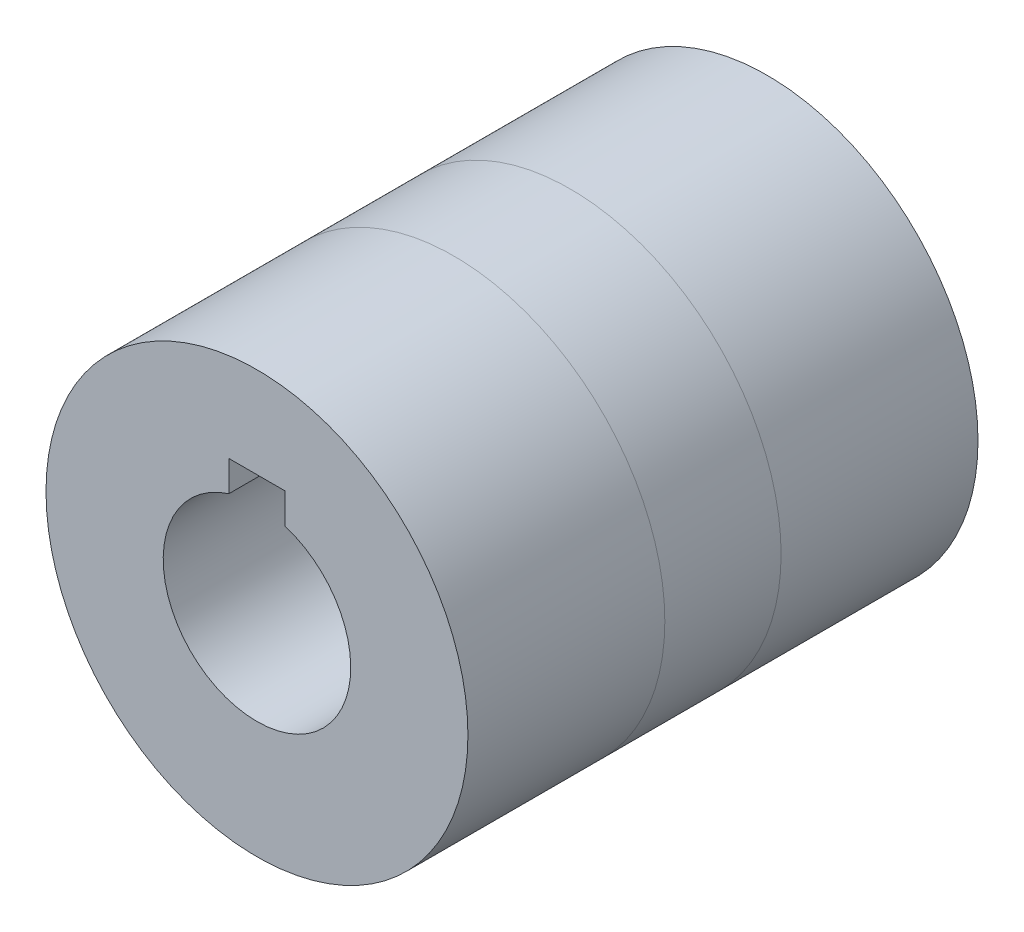
ISO-10303-21;
HEADER;
FILE_DESCRIPTION(('STEP AP214'),'2;1');
FILE_NAME('part.step','',(''),(''),'','','');
FILE_SCHEMA(('AUTOMOTIVE_DESIGN { 1 0 10303 214 1 1 1 1 }'));
ENDSEC;
DATA;
#1=APPLICATION_CONTEXT('core data for automotive mechanical design processes');
#2=APPLICATION_PROTOCOL_DEFINITION('international standard','automotive_design',2000,#1);
#3=PRODUCT_CONTEXT('',#1,'mechanical');
#4=PRODUCT('Part','Part','',(#3));
#5=PRODUCT_RELATED_PRODUCT_CATEGORY('part','',(#4));
#6=PRODUCT_DEFINITION_FORMATION('','',#4);
#7=PRODUCT_DEFINITION_CONTEXT('part definition',#1,'design');
#8=PRODUCT_DEFINITION('design','',#6,#7);
#9=PRODUCT_DEFINITION_SHAPE('','',#8);
#10=(LENGTH_UNIT() NAMED_UNIT(*) SI_UNIT(.MILLI.,.METRE.));
#11=(NAMED_UNIT(*) PLANE_ANGLE_UNIT() SI_UNIT($,.RADIAN.));
#12=(NAMED_UNIT(*) SI_UNIT($,.STERADIAN.) SOLID_ANGLE_UNIT());
#13=UNCERTAINTY_MEASURE_WITH_UNIT(LENGTH_MEASURE(1.E-05),#10,'distance_accuracy_value','');
#14=(GEOMETRIC_REPRESENTATION_CONTEXT(3) GLOBAL_UNCERTAINTY_ASSIGNED_CONTEXT((#13)) GLOBAL_UNIT_ASSIGNED_CONTEXT((#10,
#11,#12)) REPRESENTATION_CONTEXT('',''));
#15=CARTESIAN_POINT('',(0.,0.,0.));
#16=DIRECTION('',(0.,0.,1.));
#17=DIRECTION('',(1.,0.,0.));
#18=AXIS2_PLACEMENT_3D('',#15,#16,#17);
#19=CARTESIAN_POINT('',(0.,0.,-27.2));
#20=DIRECTION('',(0.,0.,-1.));
#21=DIRECTION('',(-1.,0.,0.));
#22=AXIS2_PLACEMENT_3D('',#19,#20,#21);
#23=PLANE('',#22);
#24=DIRECTION('',(0.,-1.,0.));
#25=VECTOR('',#24,1.);
#26=CARTESIAN_POINT('',(-3.,7.2,-27.2));
#27=LINE('',#26,#25);
#28=CARTESIAN_POINT('',(-3.,12.8,-27.2));
#29=VERTEX_POINT('',#28);
#30=CARTESIAN_POINT('',(-3.,9.53939201416946,-27.2));
#31=VERTEX_POINT('',#30);
#32=EDGE_CURVE('E104',#29,#31,#27,.T.);
#33=ORIENTED_EDGE('',*,*,#32,.T.);
#34=CARTESIAN_POINT('',(0.,0.,-27.2));
#35=DIRECTION('',(0.,0.,-1.));
#36=DIRECTION('',(-1.,0.,0.));
#37=AXIS2_PLACEMENT_3D('',#34,#35,#36);
#38=CIRCLE('',#37,10.);
#39=CARTESIAN_POINT('',(3.,9.53939201416946,-27.2));
#40=VERTEX_POINT('',#39);
#41=EDGE_CURVE('E103',#40,#31,#38,.T.);
#42=ORIENTED_EDGE('',*,*,#41,.F.);
#43=DIRECTION('',(0.,1.,0.));
#44=VECTOR('',#43,1.);
#45=CARTESIAN_POINT('',(3.,7.2,-27.2));
#46=LINE('',#45,#44);
#47=CARTESIAN_POINT('',(3.,12.8,-27.2));
#48=VERTEX_POINT('',#47);
#49=EDGE_CURVE('E60',#40,#48,#46,.T.);
#50=ORIENTED_EDGE('',*,*,#49,.T.);
#51=DIRECTION('',(-1.,0.,0.));
#52=VECTOR('',#51,1.);
#53=CARTESIAN_POINT('',(3.,12.8,-27.2));
#54=LINE('',#53,#52);
#55=EDGE_CURVE('E92',#48,#29,#54,.T.);
#56=ORIENTED_EDGE('',*,*,#55,.T.);
#57=EDGE_LOOP('',(#33,#42,#50,#56));
#58=FACE_BOUND('',#57,.T.);
#59=CARTESIAN_POINT('',(0.,0.,-27.2));
#60=DIRECTION('',(0.,0.,-1.));
#61=DIRECTION('',(-1.,0.,0.));
#62=AXIS2_PLACEMENT_3D('',#59,#60,#61);
#63=CIRCLE('',#62,22.5);
#64=CARTESIAN_POINT('',(-22.5,0.,-27.2));
#65=VERTEX_POINT('',#64);
#66=EDGE_CURVE('E116',#65,#65,#63,.T.);
#67=ORIENTED_EDGE('',*,*,#66,.T.);
#68=EDGE_LOOP('',(#67));
#69=FACE_BOUND('',#68,.T.);
#70=ADVANCED_FACE('F45',(#58,#69),#23,.T.);
#71=CARTESIAN_POINT('',(0.,0.,-6.2));
#72=DIRECTION('',(0.,0.,-1.));
#73=DIRECTION('',(-1.,0.,0.));
#74=AXIS2_PLACEMENT_3D('',#71,#72,#73);
#75=PLANE('',#74);
#76=CARTESIAN_POINT('',(0.,0.,-6.2));
#77=DIRECTION('',(0.,0.,-1.));
#78=DIRECTION('',(-1.,0.,0.));
#79=AXIS2_PLACEMENT_3D('',#76,#77,#78);
#80=CIRCLE('',#79,22.5);
#81=CARTESIAN_POINT('',(-22.5,0.,-6.2));
#82=VERTEX_POINT('',#81);
#83=EDGE_CURVE('E113',#82,#82,#80,.T.);
#84=ORIENTED_EDGE('',*,*,#83,.F.);
#85=EDGE_LOOP('',(#84));
#86=FACE_BOUND('',#85,.T.);
#87=CARTESIAN_POINT('',(0.,0.,-6.2));
#88=DIRECTION('',(0.,0.,-1.));
#89=DIRECTION('',(-1.,0.,0.));
#90=AXIS2_PLACEMENT_3D('',#87,#88,#89);
#91=CIRCLE('',#90,10.);
#92=CARTESIAN_POINT('',(3.,9.53939201416945,-6.2));
#93=VERTEX_POINT('',#92);
#94=CARTESIAN_POINT('',(-3.,9.53939201416945,-6.2));
#95=VERTEX_POINT('',#94);
#96=EDGE_CURVE('E111',#93,#95,#91,.T.);
#97=ORIENTED_EDGE('',*,*,#96,.T.);
#98=DIRECTION('',(0.,1.,0.));
#99=VECTOR('',#98,1.);
#100=CARTESIAN_POINT('',(-3.,0.,-6.2));
#101=LINE('',#100,#99);
#102=CARTESIAN_POINT('',(-3.,12.8,-6.2));
#103=VERTEX_POINT('',#102);
#104=EDGE_CURVE('E68',#95,#103,#101,.T.);
#105=ORIENTED_EDGE('',*,*,#104,.T.);
#106=DIRECTION('',(1.,0.,0.));
#107=VECTOR('',#106,1.);
#108=CARTESIAN_POINT('',(0.,12.8,-6.2));
#109=LINE('',#108,#107);
#110=CARTESIAN_POINT('',(3.,12.8,-6.2));
#111=VERTEX_POINT('',#110);
#112=EDGE_CURVE('E12',#103,#111,#109,.T.);
#113=ORIENTED_EDGE('',*,*,#112,.T.);
#114=DIRECTION('',(0.,-1.,0.));
#115=VECTOR('',#114,1.);
#116=CARTESIAN_POINT('',(3.,0.,-6.2));
#117=LINE('',#116,#115);
#118=EDGE_CURVE('E89',#111,#93,#117,.T.);
#119=ORIENTED_EDGE('',*,*,#118,.T.);
#120=EDGE_LOOP('',(#97,#105,#113,#119));
#121=FACE_BOUND('',#120,.T.);
#122=ADVANCED_FACE('F127',(#86,#121),#75,.F.);
#123=CARTESIAN_POINT('',(0.,0.,-27.2));
#124=DIRECTION('',(0.,0.,1.));
#125=DIRECTION('',(1.,0.,0.));
#126=AXIS2_PLACEMENT_3D('',#123,#124,#125);
#127=CYLINDRICAL_SURFACE('',#126,22.5);
#128=ORIENTED_EDGE('',*,*,#66,.F.);
#129=EDGE_LOOP('',(#128));
#130=FACE_BOUND('',#129,.T.);
#131=ORIENTED_EDGE('',*,*,#83,.T.);
#132=EDGE_LOOP('',(#131));
#133=FACE_BOUND('',#132,.T.);
#134=ADVANCED_FACE('F47',(#130,#133),#127,.T.);
#135=CARTESIAN_POINT('',(0.,0.,-27.2));
#136=DIRECTION('',(0.,0.,1.));
#137=DIRECTION('',(1.,0.,0.));
#138=AXIS2_PLACEMENT_3D('',#135,#136,#137);
#139=CYLINDRICAL_SURFACE('',#138,10.);
#140=DIRECTION('',(0.,0.,1.));
#141=VECTOR('',#140,1.);
#142=CARTESIAN_POINT('',(-3.,9.53939201416945,-27.2));
#143=LINE('',#142,#141);
#144=EDGE_CURVE('E53',#95,#31,#143,.F.);
#145=ORIENTED_EDGE('',*,*,#144,.F.);
#146=ORIENTED_EDGE('',*,*,#96,.F.);
#147=DIRECTION('',(0.,0.,1.));
#148=VECTOR('',#147,1.);
#149=CARTESIAN_POINT('',(3.,9.53939201416945,-27.2));
#150=LINE('',#149,#148);
#151=EDGE_CURVE('E119',#40,#93,#150,.T.);
#152=ORIENTED_EDGE('',*,*,#151,.F.);
#153=ORIENTED_EDGE('',*,*,#41,.T.);
#154=EDGE_LOOP('',(#145,#146,#152,#153));
#155=FACE_BOUND('',#154,.T.);
#156=ADVANCED_FACE('F125',(#155),#139,.F.);
#157=CARTESIAN_POINT('',(3.,12.8,-27.2));
#158=DIRECTION('',(0.,1.,0.));
#159=DIRECTION('',(0.,0.,1.));
#160=AXIS2_PLACEMENT_3D('',#157,#158,#159);
#161=PLANE('',#160);
#162=DIRECTION('',(0.,0.,1.));
#163=VECTOR('',#162,1.);
#164=CARTESIAN_POINT('',(-3.,12.8,-27.2));
#165=LINE('',#164,#163);
#166=EDGE_CURVE('E91',#29,#103,#165,.T.);
#167=ORIENTED_EDGE('',*,*,#166,.F.);
#168=ORIENTED_EDGE('',*,*,#55,.F.);
#169=DIRECTION('',(0.,0.,1.));
#170=VECTOR('',#169,1.);
#171=CARTESIAN_POINT('',(3.,12.8,-27.2));
#172=LINE('',#171,#170);
#173=EDGE_CURVE('E85',#48,#111,#172,.T.);
#174=ORIENTED_EDGE('',*,*,#173,.T.);
#175=ORIENTED_EDGE('',*,*,#112,.F.);
#176=EDGE_LOOP('',(#167,#168,#174,#175));
#177=FACE_BOUND('',#176,.T.);
#178=ADVANCED_FACE('F95',(#177),#161,.F.);
#179=CARTESIAN_POINT('',(-3.,7.2,-27.2));
#180=DIRECTION('',(-1.,0.,0.));
#181=DIRECTION('',(0.,0.,1.));
#182=AXIS2_PLACEMENT_3D('',#179,#180,#181);
#183=PLANE('',#182);
#184=ORIENTED_EDGE('',*,*,#144,.T.);
#185=ORIENTED_EDGE('',*,*,#32,.F.);
#186=ORIENTED_EDGE('',*,*,#166,.T.);
#187=ORIENTED_EDGE('',*,*,#104,.F.);
#188=EDGE_LOOP('',(#184,#185,#186,#187));
#189=FACE_BOUND('',#188,.T.);
#190=ADVANCED_FACE('F122',(#189),#183,.F.);
#191=CARTESIAN_POINT('',(3.,7.2,-27.2));
#192=DIRECTION('',(1.,0.,0.));
#193=DIRECTION('',(0.,0.,-1.));
#194=AXIS2_PLACEMENT_3D('',#191,#192,#193);
#195=PLANE('',#194);
#196=ORIENTED_EDGE('',*,*,#173,.F.);
#197=ORIENTED_EDGE('',*,*,#49,.F.);
#198=ORIENTED_EDGE('',*,*,#151,.T.);
#199=ORIENTED_EDGE('',*,*,#118,.F.);
#200=EDGE_LOOP('',(#196,#197,#198,#199));
#201=FACE_BOUND('',#200,.T.);
#202=ADVANCED_FACE('F87',(#201),#195,.F.);
#203=CLOSED_SHELL('',(#70,#122,#134,#156,#178,#190,#202));
#204=MANIFOLD_SOLID_BREP('B2',#203);
#205=CARTESIAN_POINT('',(0.,0.,27.2));
#206=DIRECTION('',(0.,0.,1.));
#207=DIRECTION('',(1.,0.,0.));
#208=AXIS2_PLACEMENT_3D('',#205,#206,#207);
#209=PLANE('',#208);
#210=DIRECTION('',(0.,-1.,0.));
#211=VECTOR('',#210,1.);
#212=CARTESIAN_POINT('',(-3.,7.2,27.2));
#213=LINE('',#212,#211);
#214=CARTESIAN_POINT('',(-3.,12.8,27.2));
#215=VERTEX_POINT('',#214);
#216=CARTESIAN_POINT('',(-3.,9.53939201416946,27.2));
#217=VERTEX_POINT('',#216);
#218=EDGE_CURVE('E254',#215,#217,#213,.T.);
#219=ORIENTED_EDGE('',*,*,#218,.F.);
#220=DIRECTION('',(-1.,0.,0.));
#221=VECTOR('',#220,1.);
#222=CARTESIAN_POINT('',(3.,12.8,27.2));
#223=LINE('',#222,#221);
#224=CARTESIAN_POINT('',(3.,12.8,27.2));
#225=VERTEX_POINT('',#224);
#226=EDGE_CURVE('E243',#225,#215,#223,.T.);
#227=ORIENTED_EDGE('',*,*,#226,.F.);
#228=DIRECTION('',(0.,1.,0.));
#229=VECTOR('',#228,1.);
#230=CARTESIAN_POINT('',(3.,7.2,27.2));
#231=LINE('',#230,#229);
#232=CARTESIAN_POINT('',(3.,9.53939201416946,27.2));
#233=VERTEX_POINT('',#232);
#234=EDGE_CURVE('E248',#233,#225,#231,.T.);
#235=ORIENTED_EDGE('',*,*,#234,.F.);
#236=CARTESIAN_POINT('',(0.,0.,27.2));
#237=DIRECTION('',(0.,0.,1.));
#238=DIRECTION('',(1.,0.,0.));
#239=AXIS2_PLACEMENT_3D('',#236,#237,#238);
#240=CIRCLE('',#239,10.);
#241=EDGE_CURVE('E265',#217,#233,#240,.T.);
#242=ORIENTED_EDGE('',*,*,#241,.F.);
#243=EDGE_LOOP('',(#219,#227,#235,#242));
#244=FACE_BOUND('',#243,.T.);
#245=CARTESIAN_POINT('',(0.,0.,27.2));
#246=DIRECTION('',(0.,0.,1.));
#247=DIRECTION('',(1.,0.,0.));
#248=AXIS2_PLACEMENT_3D('',#245,#246,#247);
#249=CIRCLE('',#248,22.5);
#250=CARTESIAN_POINT('',(22.5,0.,27.2));
#251=VERTEX_POINT('',#250);
#252=EDGE_CURVE('E270',#251,#251,#249,.T.);
#253=ORIENTED_EDGE('',*,*,#252,.T.);
#254=EDGE_LOOP('',(#253));
#255=FACE_BOUND('',#254,.T.);
#256=ADVANCED_FACE('F198',(#244,#255),#209,.T.);
#257=CARTESIAN_POINT('',(0.,0.,6.2));
#258=DIRECTION('',(0.,0.,1.));
#259=DIRECTION('',(1.,0.,0.));
#260=AXIS2_PLACEMENT_3D('',#257,#258,#259);
#261=PLANE('',#260);
#262=CARTESIAN_POINT('',(0.,0.,6.2));
#263=DIRECTION('',(0.,0.,1.));
#264=DIRECTION('',(1.,0.,0.));
#265=AXIS2_PLACEMENT_3D('',#262,#263,#264);
#266=CIRCLE('',#265,22.5);
#267=CARTESIAN_POINT('',(22.5,0.,6.2));
#268=VERTEX_POINT('',#267);
#269=EDGE_CURVE('E267',#268,#268,#266,.T.);
#270=ORIENTED_EDGE('',*,*,#269,.F.);
#271=EDGE_LOOP('',(#270));
#272=FACE_BOUND('',#271,.T.);
#273=DIRECTION('',(-1.,0.,0.));
#274=VECTOR('',#273,1.);
#275=CARTESIAN_POINT('',(0.,12.8,6.2));
#276=LINE('',#275,#274);
#277=CARTESIAN_POINT('',(3.,12.8,6.2));
#278=VERTEX_POINT('',#277);
#279=CARTESIAN_POINT('',(-3.,12.8,6.2));
#280=VERTEX_POINT('',#279);
#281=EDGE_CURVE('E43',#278,#280,#276,.T.);
#282=ORIENTED_EDGE('',*,*,#281,.T.);
#283=DIRECTION('',(0.,-1.,0.));
#284=VECTOR('',#283,1.);
#285=CARTESIAN_POINT('',(-3.,0.,6.2));
#286=LINE('',#285,#284);
#287=CARTESIAN_POINT('',(-3.,9.53939201416945,6.2));
#288=VERTEX_POINT('',#287);
#289=EDGE_CURVE('E262',#280,#288,#286,.T.);
#290=ORIENTED_EDGE('',*,*,#289,.T.);
#291=CARTESIAN_POINT('',(0.,0.,6.2));
#292=DIRECTION('',(0.,0.,1.));
#293=DIRECTION('',(1.,0.,0.));
#294=AXIS2_PLACEMENT_3D('',#291,#292,#293);
#295=CIRCLE('',#294,10.);
#296=CARTESIAN_POINT('',(3.,9.53939201416946,6.2));
#297=VERTEX_POINT('',#296);
#298=EDGE_CURVE('E264',#288,#297,#295,.T.);
#299=ORIENTED_EDGE('',*,*,#298,.T.);
#300=DIRECTION('',(0.,1.,0.));
#301=VECTOR('',#300,1.);
#302=CARTESIAN_POINT('',(3.,0.,6.2));
#303=LINE('',#302,#301);
#304=EDGE_CURVE('E213',#297,#278,#303,.T.);
#305=ORIENTED_EDGE('',*,*,#304,.T.);
#306=EDGE_LOOP('',(#282,#290,#299,#305));
#307=FACE_BOUND('',#306,.T.);
#308=ADVANCED_FACE('F278',(#272,#307),#261,.F.);
#309=CARTESIAN_POINT('',(0.,0.,27.2));
#310=DIRECTION('',(0.,0.,-1.));
#311=DIRECTION('',(-1.,0.,0.));
#312=AXIS2_PLACEMENT_3D('',#309,#310,#311);
#313=CYLINDRICAL_SURFACE('',#312,22.5);
#314=ORIENTED_EDGE('',*,*,#252,.F.);
#315=EDGE_LOOP('',(#314));
#316=FACE_BOUND('',#315,.T.);
#317=ORIENTED_EDGE('',*,*,#269,.T.);
#318=EDGE_LOOP('',(#317));
#319=FACE_BOUND('',#318,.T.);
#320=ADVANCED_FACE('F200',(#316,#319),#313,.T.);
#321=CARTESIAN_POINT('',(0.,0.,27.2));
#322=DIRECTION('',(0.,0.,-1.));
#323=DIRECTION('',(-1.,0.,0.));
#324=AXIS2_PLACEMENT_3D('',#321,#322,#323);
#325=CYLINDRICAL_SURFACE('',#324,10.);
#326=DIRECTION('',(0.,0.,-1.));
#327=VECTOR('',#326,1.);
#328=CARTESIAN_POINT('',(-3.,9.53939201416945,27.2));
#329=LINE('',#328,#327);
#330=EDGE_CURVE('E206',#217,#288,#329,.T.);
#331=ORIENTED_EDGE('',*,*,#330,.F.);
#332=ORIENTED_EDGE('',*,*,#241,.T.);
#333=DIRECTION('',(0.,0.,-1.));
#334=VECTOR('',#333,1.);
#335=CARTESIAN_POINT('',(3.,9.53939201416945,27.2));
#336=LINE('',#335,#334);
#337=EDGE_CURVE('E250',#297,#233,#336,.F.);
#338=ORIENTED_EDGE('',*,*,#337,.F.);
#339=ORIENTED_EDGE('',*,*,#298,.F.);
#340=EDGE_LOOP('',(#331,#332,#338,#339));
#341=FACE_BOUND('',#340,.T.);
#342=ADVANCED_FACE('F283',(#341),#325,.F.);
#343=CARTESIAN_POINT('',(3.,12.8,-27.2));
#344=DIRECTION('',(0.,1.,0.));
#345=DIRECTION('',(0.,0.,1.));
#346=AXIS2_PLACEMENT_3D('',#343,#344,#345);
#347=PLANE('',#346);
#348=DIRECTION('',(0.,0.,1.));
#349=VECTOR('',#348,1.);
#350=CARTESIAN_POINT('',(3.,12.8,-27.2));
#351=LINE('',#350,#349);
#352=EDGE_CURVE('E238',#278,#225,#351,.T.);
#353=ORIENTED_EDGE('',*,*,#352,.T.);
#354=ORIENTED_EDGE('',*,*,#226,.T.);
#355=DIRECTION('',(0.,0.,1.));
#356=VECTOR('',#355,1.);
#357=CARTESIAN_POINT('',(-3.,12.8,-27.2));
#358=LINE('',#357,#356);
#359=EDGE_CURVE('E245',#280,#215,#358,.T.);
#360=ORIENTED_EDGE('',*,*,#359,.F.);
#361=ORIENTED_EDGE('',*,*,#281,.F.);
#362=EDGE_LOOP('',(#353,#354,#360,#361));
#363=FACE_BOUND('',#362,.T.);
#364=ADVANCED_FACE('F240',(#363),#347,.F.);
#365=CARTESIAN_POINT('',(-3.,7.2,-27.2));
#366=DIRECTION('',(-1.,0.,0.));
#367=DIRECTION('',(0.,0.,1.));
#368=AXIS2_PLACEMENT_3D('',#365,#366,#367);
#369=PLANE('',#368);
#370=ORIENTED_EDGE('',*,*,#359,.T.);
#371=ORIENTED_EDGE('',*,*,#218,.T.);
#372=ORIENTED_EDGE('',*,*,#330,.T.);
#373=ORIENTED_EDGE('',*,*,#289,.F.);
#374=EDGE_LOOP('',(#370,#371,#372,#373));
#375=FACE_BOUND('',#374,.T.);
#376=ADVANCED_FACE('F290',(#375),#369,.F.);
#377=CARTESIAN_POINT('',(3.,7.2,-27.2));
#378=DIRECTION('',(1.,0.,0.));
#379=DIRECTION('',(0.,0.,-1.));
#380=AXIS2_PLACEMENT_3D('',#377,#378,#379);
#381=PLANE('',#380);
#382=ORIENTED_EDGE('',*,*,#337,.T.);
#383=ORIENTED_EDGE('',*,*,#234,.T.);
#384=ORIENTED_EDGE('',*,*,#352,.F.);
#385=ORIENTED_EDGE('',*,*,#304,.F.);
#386=EDGE_LOOP('',(#382,#383,#384,#385));
#387=FACE_BOUND('',#386,.T.);
#388=ADVANCED_FACE('F249',(#387),#381,.F.);
#389=CLOSED_SHELL('',(#256,#308,#320,#342,#364,#376,#388));
#390=MANIFOLD_SOLID_BREP('B6',#389);
#391=CARTESIAN_POINT('',(0.,0.,6.2));
#392=DIRECTION('',(0.,0.,1.));
#393=DIRECTION('',(1.,0.,0.));
#394=AXIS2_PLACEMENT_3D('',#391,#392,#393);
#395=PLANE('',#394);
#396=DIRECTION('',(0.,-1.,0.));
#397=VECTOR('',#396,1.);
#398=CARTESIAN_POINT('',(-3.,0.,6.2));
#399=LINE('',#398,#397);
#400=CARTESIAN_POINT('',(-3.,12.8,6.2));
#401=VERTEX_POINT('',#400);
#402=CARTESIAN_POINT('',(-3.,9.53939201416945,6.2));
#403=VERTEX_POINT('',#402);
#404=EDGE_CURVE('E403',#401,#403,#399,.T.);
#405=ORIENTED_EDGE('',*,*,#404,.F.);
#406=DIRECTION('',(-1.,0.,0.));
#407=VECTOR('',#406,1.);
#408=CARTESIAN_POINT('',(0.,12.8,6.2));
#409=LINE('',#408,#407);
#410=CARTESIAN_POINT('',(3.,12.8,6.2));
#411=VERTEX_POINT('',#410);
#412=EDGE_CURVE('E405',#411,#401,#409,.T.);
#413=ORIENTED_EDGE('',*,*,#412,.F.);
#414=DIRECTION('',(0.,1.,0.));
#415=VECTOR('',#414,1.);
#416=CARTESIAN_POINT('',(3.,0.,6.2));
#417=LINE('',#416,#415);
#418=CARTESIAN_POINT('',(3.,9.53939201416945,6.2));
#419=VERTEX_POINT('',#418);
#420=EDGE_CURVE('E391',#419,#411,#417,.T.);
#421=ORIENTED_EDGE('',*,*,#420,.F.);
#422=CARTESIAN_POINT('',(0.,0.,6.2));
#423=DIRECTION('',(0.,0.,1.));
#424=DIRECTION('',(1.,0.,0.));
#425=AXIS2_PLACEMENT_3D('',#422,#423,#424);
#426=CIRCLE('',#425,10.);
#427=EDGE_CURVE('E407',#403,#419,#426,.T.);
#428=ORIENTED_EDGE('',*,*,#427,.F.);
#429=EDGE_LOOP('',(#405,#413,#421,#428));
#430=FACE_BOUND('',#429,.T.);
#431=CARTESIAN_POINT('',(0.,0.,6.2));
#432=DIRECTION('',(0.,0.,1.));
#433=DIRECTION('',(1.,0.,0.));
#434=AXIS2_PLACEMENT_3D('',#431,#432,#433);
#435=CIRCLE('',#434,22.5);
#436=CARTESIAN_POINT('',(22.5,0.,6.2));
#437=VERTEX_POINT('',#436);
#438=EDGE_CURVE('E412',#437,#437,#435,.T.);
#439=ORIENTED_EDGE('',*,*,#438,.T.);
#440=EDGE_LOOP('',(#439));
#441=FACE_BOUND('',#440,.T.);
#442=ADVANCED_FACE('F342',(#430,#441),#395,.T.);
#443=CARTESIAN_POINT('',(0.,0.,-6.2));
#444=DIRECTION('',(0.,0.,1.));
#445=DIRECTION('',(1.,0.,0.));
#446=AXIS2_PLACEMENT_3D('',#443,#444,#445);
#447=PLANE('',#446);
#448=CARTESIAN_POINT('',(0.,0.,-6.2));
#449=DIRECTION('',(0.,0.,1.));
#450=DIRECTION('',(1.,0.,0.));
#451=AXIS2_PLACEMENT_3D('',#448,#449,#450);
#452=CIRCLE('',#451,22.5);
#453=CARTESIAN_POINT('',(22.5,0.,-6.2));
#454=VERTEX_POINT('',#453);
#455=EDGE_CURVE('E410',#454,#454,#452,.T.);
#456=ORIENTED_EDGE('',*,*,#455,.F.);
#457=EDGE_LOOP('',(#456));
#458=FACE_BOUND('',#457,.T.);
#459=DIRECTION('',(-1.,0.,0.));
#460=VECTOR('',#459,1.);
#461=CARTESIAN_POINT('',(0.,12.8,-6.2));
#462=LINE('',#461,#460);
#463=CARTESIAN_POINT('',(3.,12.8,-6.2));
#464=VERTEX_POINT('',#463);
#465=CARTESIAN_POINT('',(-3.,12.8,-6.2));
#466=VERTEX_POINT('',#465);
#467=EDGE_CURVE('E196',#464,#466,#462,.T.);
#468=ORIENTED_EDGE('',*,*,#467,.T.);
#469=DIRECTION('',(0.,-1.,0.));
#470=VECTOR('',#469,1.);
#471=CARTESIAN_POINT('',(-3.,0.,-6.2));
#472=LINE('',#471,#470);
#473=CARTESIAN_POINT('',(-3.,9.53939201416945,-6.2));
#474=VERTEX_POINT('',#473);
#475=EDGE_CURVE('E398',#466,#474,#472,.T.);
#476=ORIENTED_EDGE('',*,*,#475,.T.);
#477=CARTESIAN_POINT('',(0.,0.,-6.2));
#478=DIRECTION('',(0.,0.,1.));
#479=DIRECTION('',(1.,0.,0.));
#480=AXIS2_PLACEMENT_3D('',#477,#478,#479);
#481=CIRCLE('',#480,10.);
#482=CARTESIAN_POINT('',(3.,9.53939201416946,-6.2));
#483=VERTEX_POINT('',#482);
#484=EDGE_CURVE('E396',#474,#483,#481,.T.);
#485=ORIENTED_EDGE('',*,*,#484,.T.);
#486=DIRECTION('',(0.,1.,0.));
#487=VECTOR('',#486,1.);
#488=CARTESIAN_POINT('',(3.,0.,-6.2));
#489=LINE('',#488,#487);
#490=EDGE_CURVE('E357',#483,#464,#489,.T.);
#491=ORIENTED_EDGE('',*,*,#490,.T.);
#492=EDGE_LOOP('',(#468,#476,#485,#491));
#493=FACE_BOUND('',#492,.T.);
#494=ADVANCED_FACE('F394',(#458,#493),#447,.F.);
#495=CARTESIAN_POINT('',(0.,0.,6.2));
#496=DIRECTION('',(0.,0.,-1.));
#497=DIRECTION('',(-1.,0.,0.));
#498=AXIS2_PLACEMENT_3D('',#495,#496,#497);
#499=CYLINDRICAL_SURFACE('',#498,22.5);
#500=ORIENTED_EDGE('',*,*,#438,.F.);
#501=EDGE_LOOP('',(#500));
#502=FACE_BOUND('',#501,.T.);
#503=ORIENTED_EDGE('',*,*,#455,.T.);
#504=EDGE_LOOP('',(#503));
#505=FACE_BOUND('',#504,.T.);
#506=ADVANCED_FACE('F344',(#502,#505),#499,.T.);
#507=CARTESIAN_POINT('',(0.,0.,6.2));
#508=DIRECTION('',(0.,0.,-1.));
#509=DIRECTION('',(-1.,0.,0.));
#510=AXIS2_PLACEMENT_3D('',#507,#508,#509);
#511=CYLINDRICAL_SURFACE('',#510,10.);
#512=DIRECTION('',(0.,0.,-1.));
#513=VECTOR('',#512,1.);
#514=CARTESIAN_POINT('',(-3.,9.53939201416945,6.2));
#515=LINE('',#514,#513);
#516=EDGE_CURVE('E350',#403,#474,#515,.T.);
#517=ORIENTED_EDGE('',*,*,#516,.F.);
#518=ORIENTED_EDGE('',*,*,#427,.T.);
#519=DIRECTION('',(0.,0.,-1.));
#520=VECTOR('',#519,1.);
#521=CARTESIAN_POINT('',(3.,9.53939201416945,6.2));
#522=LINE('',#521,#520);
#523=EDGE_CURVE('E415',#483,#419,#522,.F.);
#524=ORIENTED_EDGE('',*,*,#523,.F.);
#525=ORIENTED_EDGE('',*,*,#484,.F.);
#526=EDGE_LOOP('',(#517,#518,#524,#525));
#527=FACE_BOUND('',#526,.T.);
#528=ADVANCED_FACE('F423',(#527),#511,.F.);
#529=CARTESIAN_POINT('',(3.,12.8,-27.2));
#530=DIRECTION('',(0.,1.,0.));
#531=DIRECTION('',(0.,0.,1.));
#532=AXIS2_PLACEMENT_3D('',#529,#530,#531);
#533=PLANE('',#532);
#534=ORIENTED_EDGE('',*,*,#412,.T.);
#535=DIRECTION('',(0.,0.,1.));
#536=VECTOR('',#535,1.);
#537=CARTESIAN_POINT('',(-3.,12.8,-27.2));
#538=LINE('',#537,#536);
#539=EDGE_CURVE('E387',#466,#401,#538,.T.);
#540=ORIENTED_EDGE('',*,*,#539,.F.);
#541=ORIENTED_EDGE('',*,*,#467,.F.);
#542=DIRECTION('',(0.,0.,1.));
#543=VECTOR('',#542,1.);
#544=CARTESIAN_POINT('',(3.,12.8,-27.2));
#545=LINE('',#544,#543);
#546=EDGE_CURVE('E384',#464,#411,#545,.T.);
#547=ORIENTED_EDGE('',*,*,#546,.T.);
#548=EDGE_LOOP('',(#534,#540,#541,#547));
#549=FACE_BOUND('',#548,.T.);
#550=ADVANCED_FACE('F383',(#549),#533,.F.);
#551=CARTESIAN_POINT('',(-3.,7.2,-27.2));
#552=DIRECTION('',(-1.,0.,0.));
#553=DIRECTION('',(0.,0.,1.));
#554=AXIS2_PLACEMENT_3D('',#551,#552,#553);
#555=PLANE('',#554);
#556=ORIENTED_EDGE('',*,*,#404,.T.);
#557=ORIENTED_EDGE('',*,*,#516,.T.);
#558=ORIENTED_EDGE('',*,*,#475,.F.);
#559=ORIENTED_EDGE('',*,*,#539,.T.);
#560=EDGE_LOOP('',(#556,#557,#558,#559));
#561=FACE_BOUND('',#560,.T.);
#562=ADVANCED_FACE('F430',(#561),#555,.F.);
#563=CARTESIAN_POINT('',(3.,7.2,-27.2));
#564=DIRECTION('',(1.,0.,0.));
#565=DIRECTION('',(0.,0.,-1.));
#566=AXIS2_PLACEMENT_3D('',#563,#564,#565);
#567=PLANE('',#566);
#568=ORIENTED_EDGE('',*,*,#420,.T.);
#569=ORIENTED_EDGE('',*,*,#546,.F.);
#570=ORIENTED_EDGE('',*,*,#490,.F.);
#571=ORIENTED_EDGE('',*,*,#523,.T.);
#572=EDGE_LOOP('',(#568,#569,#570,#571));
#573=FACE_BOUND('',#572,.T.);
#574=ADVANCED_FACE('F389',(#573),#567,.F.);
#575=CLOSED_SHELL('',(#442,#494,#506,#528,#550,#562,#574));
#576=MANIFOLD_SOLID_BREP('B37',#575);
#577=ADVANCED_BREP_SHAPE_REPRESENTATION('',(#18,#204,#390,#576),#14);
#578=SHAPE_DEFINITION_REPRESENTATION(#9,#577);
ENDSEC;
END-ISO-10303-21;
